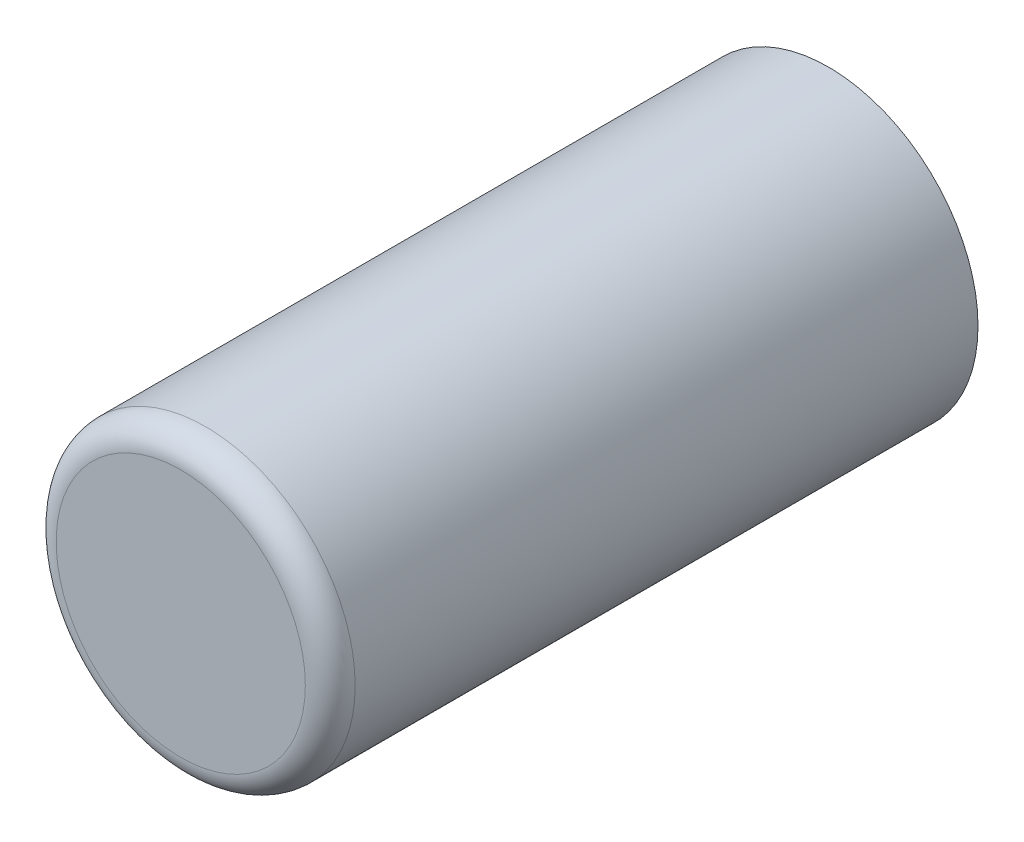
ISO-10303-21;
HEADER;
FILE_DESCRIPTION(('STEP AP214'),'2;1');
FILE_NAME('part.step','',(''),(''),'','','');
FILE_SCHEMA(('AUTOMOTIVE_DESIGN { 1 0 10303 214 1 1 1 1 }'));
ENDSEC;
DATA;
#1=APPLICATION_CONTEXT('core data for automotive mechanical design processes');
#2=APPLICATION_PROTOCOL_DEFINITION('international standard','automotive_design',2000,#1);
#3=PRODUCT_CONTEXT('',#1,'mechanical');
#4=PRODUCT('Part','Part','',(#3));
#5=PRODUCT_RELATED_PRODUCT_CATEGORY('part','',(#4));
#6=PRODUCT_DEFINITION_FORMATION('','',#4);
#7=PRODUCT_DEFINITION_CONTEXT('part definition',#1,'design');
#8=PRODUCT_DEFINITION('design','',#6,#7);
#9=PRODUCT_DEFINITION_SHAPE('','',#8);
#10=(LENGTH_UNIT() NAMED_UNIT(*) SI_UNIT(.MILLI.,.METRE.));
#11=(NAMED_UNIT(*) PLANE_ANGLE_UNIT() SI_UNIT($,.RADIAN.));
#12=(NAMED_UNIT(*) SI_UNIT($,.STERADIAN.) SOLID_ANGLE_UNIT());
#13=UNCERTAINTY_MEASURE_WITH_UNIT(LENGTH_MEASURE(1.E-05),#10,'distance_accuracy_value','');
#14=(GEOMETRIC_REPRESENTATION_CONTEXT(3) GLOBAL_UNCERTAINTY_ASSIGNED_CONTEXT((#13)) GLOBAL_UNIT_ASSIGNED_CONTEXT((#10,
#11,#12)) REPRESENTATION_CONTEXT('',''));
#15=CARTESIAN_POINT('',(0.,0.,0.));
#16=DIRECTION('',(0.,0.,1.));
#17=DIRECTION('',(1.,0.,0.));
#18=AXIS2_PLACEMENT_3D('',#15,#16,#17);
#19=CARTESIAN_POINT('',(0.,0.,10.4));
#20=DIRECTION('',(0.,0.,-1.));
#21=DIRECTION('',(-1.,0.,0.));
#22=AXIS2_PLACEMENT_3D('',#19,#20,#21);
#23=CYLINDRICAL_SURFACE('',#22,4.8);
#24=CARTESIAN_POINT('',(0.,0.,9.6));
#25=DIRECTION('',(0.,0.,1.));
#26=DIRECTION('',(1.,0.,0.));
#27=AXIS2_PLACEMENT_3D('',#24,#25,#26);
#28=CIRCLE('',#27,4.8);
#29=CARTESIAN_POINT('',(4.8,0.,9.6));
#30=VERTEX_POINT('',#29);
#31=EDGE_CURVE('E10',#30,#30,#28,.F.);
#32=ORIENTED_EDGE('',*,*,#31,.T.);
#33=EDGE_LOOP('',(#32));
#34=FACE_BOUND('',#33,.T.);
#35=CARTESIAN_POINT('',(0.,0.,-10.4));
#36=DIRECTION('',(0.,0.,1.));
#37=DIRECTION('',(1.,0.,0.));
#38=AXIS2_PLACEMENT_3D('',#35,#36,#37);
#39=CIRCLE('',#38,4.8);
#40=CARTESIAN_POINT('',(4.8,0.,-10.4));
#41=VERTEX_POINT('',#40);
#42=EDGE_CURVE('E45',#41,#41,#39,.T.);
#43=ORIENTED_EDGE('',*,*,#42,.T.);
#44=EDGE_LOOP('',(#43));
#45=FACE_BOUND('',#44,.T.);
#46=ADVANCED_FACE('F34',(#34,#45),#23,.T.);
#47=CARTESIAN_POINT('',(0.,0.,10.4));
#48=DIRECTION('',(0.,0.,1.));
#49=DIRECTION('',(1.,0.,0.));
#50=AXIS2_PLACEMENT_3D('',#47,#48,#49);
#51=PLANE('',#50);
#52=CARTESIAN_POINT('',(0.,0.,10.4));
#53=DIRECTION('',(0.,0.,1.));
#54=DIRECTION('',(1.,0.,0.));
#55=AXIS2_PLACEMENT_3D('',#52,#53,#54);
#56=CIRCLE('',#55,4.);
#57=CARTESIAN_POINT('',(4.,0.,10.4));
#58=VERTEX_POINT('',#57);
#59=EDGE_CURVE('E41',#58,#58,#56,.T.);
#60=ORIENTED_EDGE('',*,*,#59,.T.);
#61=EDGE_LOOP('',(#60));
#62=FACE_BOUND('',#61,.T.);
#63=ADVANCED_FACE('F55',(#62),#51,.T.);
#64=CARTESIAN_POINT('',(0.,0.,-10.4));
#65=DIRECTION('',(0.,0.,1.));
#66=DIRECTION('',(1.,0.,0.));
#67=AXIS2_PLACEMENT_3D('',#64,#65,#66);
#68=PLANE('',#67);
#69=ORIENTED_EDGE('',*,*,#42,.F.);
#70=EDGE_LOOP('',(#69));
#71=FACE_BOUND('',#70,.T.);
#72=ADVANCED_FACE('F53',(#71),#68,.F.);
#73=CARTESIAN_POINT('',(0.,0.,9.6));
#74=DIRECTION('',(0.,0.,1.));
#75=DIRECTION('',(1.,0.,0.));
#76=AXIS2_PLACEMENT_3D('',#73,#74,#75);
#77=TOROIDAL_SURFACE('',#76,4.,0.8);
#78=ORIENTED_EDGE('',*,*,#31,.F.);
#79=EDGE_LOOP('',(#78));
#80=FACE_BOUND('',#79,.T.);
#81=ORIENTED_EDGE('',*,*,#59,.F.);
#82=EDGE_LOOP('',(#81));
#83=FACE_BOUND('',#82,.T.);
#84=ADVANCED_FACE('F36',(#80,#83),#77,.T.);
#85=CLOSED_SHELL('',(#46,#63,#72,#84));
#86=MANIFOLD_SOLID_BREP('B2',#85);
#87=ADVANCED_BREP_SHAPE_REPRESENTATION('',(#18,#86),#14);
#88=SHAPE_DEFINITION_REPRESENTATION(#9,#87);
ENDSEC;
END-ISO-10303-21;
